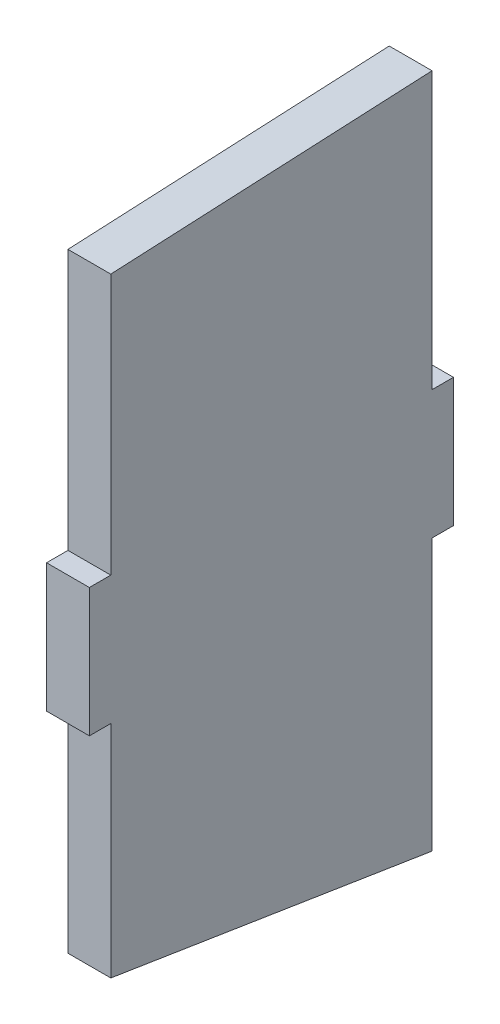
ISO-10303-21;
HEADER;
FILE_DESCRIPTION(('STEP AP214'),'2;1');
FILE_NAME('part.step','',(''),(''),'','','');
FILE_SCHEMA(('AUTOMOTIVE_DESIGN { 1 0 10303 214 1 1 1 1 }'));
ENDSEC;
DATA;
#1=APPLICATION_CONTEXT('core data for automotive mechanical design processes');
#2=APPLICATION_PROTOCOL_DEFINITION('international standard','automotive_design',2000,#1);
#3=PRODUCT_CONTEXT('',#1,'mechanical');
#4=PRODUCT('Part','Part','',(#3));
#5=PRODUCT_RELATED_PRODUCT_CATEGORY('part','',(#4));
#6=PRODUCT_DEFINITION_FORMATION('','',#4);
#7=PRODUCT_DEFINITION_CONTEXT('part definition',#1,'design');
#8=PRODUCT_DEFINITION('design','',#6,#7);
#9=PRODUCT_DEFINITION_SHAPE('','',#8);
#10=(LENGTH_UNIT() NAMED_UNIT(*) SI_UNIT(.MILLI.,.METRE.));
#11=(NAMED_UNIT(*) PLANE_ANGLE_UNIT() SI_UNIT($,.RADIAN.));
#12=(NAMED_UNIT(*) SI_UNIT($,.STERADIAN.) SOLID_ANGLE_UNIT());
#13=UNCERTAINTY_MEASURE_WITH_UNIT(LENGTH_MEASURE(1.E-05),#10,'distance_accuracy_value','');
#14=(GEOMETRIC_REPRESENTATION_CONTEXT(3) GLOBAL_UNCERTAINTY_ASSIGNED_CONTEXT((#13)) GLOBAL_UNIT_ASSIGNED_CONTEXT((#10,
#11,#12)) REPRESENTATION_CONTEXT('',''));
#15=CARTESIAN_POINT('',(0.,0.,0.));
#16=DIRECTION('',(0.,0.,1.));
#17=DIRECTION('',(1.,0.,0.));
#18=AXIS2_PLACEMENT_3D('',#15,#16,#17);
#19=CARTESIAN_POINT('',(25.4,0.,95.25));
#20=DIRECTION('',(0.,0.,1.));
#21=DIRECTION('',(1.,0.,0.));
#22=AXIS2_PLACEMENT_3D('',#19,#20,#21);
#23=PLANE('',#22);
#24=DIRECTION('',(0.,1.,0.));
#25=VECTOR('',#24,1.);
#26=CARTESIAN_POINT('',(0.,0.,95.25));
#27=LINE('',#26,#25);
#28=CARTESIAN_POINT('',(0.,38.1,95.25));
#29=VERTEX_POINT('',#28);
#30=CARTESIAN_POINT('',(0.,192.69579571,95.25));
#31=VERTEX_POINT('',#30);
#32=EDGE_CURVE('E159',#29,#31,#27,.T.);
#33=ORIENTED_EDGE('',*,*,#32,.F.);
#34=DIRECTION('',(-1.,0.,0.));
#35=VECTOR('',#34,1.);
#36=CARTESIAN_POINT('',(25.4,38.1,95.25));
#37=LINE('',#36,#35);
#38=CARTESIAN_POINT('',(25.4,38.1,95.25));
#39=VERTEX_POINT('',#38);
#40=EDGE_CURVE('E11',#39,#29,#37,.T.);
#41=ORIENTED_EDGE('',*,*,#40,.F.);
#42=DIRECTION('',(0.,1.,0.));
#43=VECTOR('',#42,1.);
#44=CARTESIAN_POINT('',(25.4,0.,95.25));
#45=LINE('',#44,#43);
#46=CARTESIAN_POINT('',(25.4,192.69579571,95.25));
#47=VERTEX_POINT('',#46);
#48=EDGE_CURVE('E188',#39,#47,#45,.T.);
#49=ORIENTED_EDGE('',*,*,#48,.T.);
#50=DIRECTION('',(-1.,0.,0.));
#51=VECTOR('',#50,1.);
#52=CARTESIAN_POINT('',(25.4,192.69579571,95.25));
#53=LINE('',#52,#51);
#54=EDGE_CURVE('E57',#47,#31,#53,.T.);
#55=ORIENTED_EDGE('',*,*,#54,.T.);
#56=EDGE_LOOP('',(#33,#41,#49,#55));
#57=FACE_BOUND('',#56,.T.);
#58=ADVANCED_FACE('F41',(#57),#23,.T.);
#59=CARTESIAN_POINT('',(25.4,38.1,0.));
#60=DIRECTION('',(0.,1.,0.));
#61=DIRECTION('',(0.,0.,1.));
#62=AXIS2_PLACEMENT_3D('',#59,#60,#61);
#63=PLANE('',#62);
#64=DIRECTION('',(0.,0.,-1.));
#65=VECTOR('',#64,1.);
#66=CARTESIAN_POINT('',(0.,38.1,0.));
#67=LINE('',#66,#65);
#68=CARTESIAN_POINT('',(0.,38.1,107.95));
#69=VERTEX_POINT('',#68);
#70=EDGE_CURVE('E161',#69,#29,#67,.T.);
#71=ORIENTED_EDGE('',*,*,#70,.F.);
#72=DIRECTION('',(-1.,0.,0.));
#73=VECTOR('',#72,1.);
#74=CARTESIAN_POINT('',(25.4,38.1,107.95));
#75=LINE('',#74,#73);
#76=CARTESIAN_POINT('',(25.4,38.1,107.95));
#77=VERTEX_POINT('',#76);
#78=EDGE_CURVE('E49',#77,#69,#75,.T.);
#79=ORIENTED_EDGE('',*,*,#78,.F.);
#80=DIRECTION('',(0.,0.,-1.));
#81=VECTOR('',#80,1.);
#82=CARTESIAN_POINT('',(25.4,38.1,0.));
#83=LINE('',#82,#81);
#84=EDGE_CURVE('E231',#77,#39,#83,.T.);
#85=ORIENTED_EDGE('',*,*,#84,.T.);
#86=ORIENTED_EDGE('',*,*,#40,.T.);
#87=EDGE_LOOP('',(#71,#79,#85,#86));
#88=FACE_BOUND('',#87,.T.);
#89=ADVANCED_FACE('F216',(#88),#63,.T.);
#90=CARTESIAN_POINT('',(25.4,0.,107.95));
#91=DIRECTION('',(0.,0.,1.));
#92=DIRECTION('',(1.,0.,0.));
#93=AXIS2_PLACEMENT_3D('',#90,#91,#92);
#94=PLANE('',#93);
#95=DIRECTION('',(0.,1.,0.));
#96=VECTOR('',#95,1.);
#97=CARTESIAN_POINT('',(0.,0.,107.95));
#98=LINE('',#97,#96);
#99=CARTESIAN_POINT('',(0.,-38.1,107.95));
#100=VERTEX_POINT('',#99);
#101=EDGE_CURVE('E164',#100,#69,#98,.T.);
#102=ORIENTED_EDGE('',*,*,#101,.F.);
#103=DIRECTION('',(-1.,0.,0.));
#104=VECTOR('',#103,1.);
#105=CARTESIAN_POINT('',(25.4,-38.1,107.95));
#106=LINE('',#105,#104);
#107=CARTESIAN_POINT('',(25.4,-38.1,107.95));
#108=VERTEX_POINT('',#107);
#109=EDGE_CURVE('E205',#108,#100,#106,.T.);
#110=ORIENTED_EDGE('',*,*,#109,.F.);
#111=DIRECTION('',(0.,1.,0.));
#112=VECTOR('',#111,1.);
#113=CARTESIAN_POINT('',(25.4,0.,107.95));
#114=LINE('',#113,#112);
#115=EDGE_CURVE('E212',#108,#77,#114,.T.);
#116=ORIENTED_EDGE('',*,*,#115,.T.);
#117=ORIENTED_EDGE('',*,*,#78,.T.);
#118=EDGE_LOOP('',(#102,#110,#116,#117));
#119=FACE_BOUND('',#118,.T.);
#120=ADVANCED_FACE('F210',(#119),#94,.T.);
#121=CARTESIAN_POINT('',(25.4,-38.1,0.));
#122=DIRECTION('',(0.,1.,0.));
#123=DIRECTION('',(0.,0.,1.));
#124=AXIS2_PLACEMENT_3D('',#121,#122,#123);
#125=PLANE('',#124);
#126=DIRECTION('',(0.,0.,-1.));
#127=VECTOR('',#126,1.);
#128=CARTESIAN_POINT('',(0.,-38.1,0.));
#129=LINE('',#128,#127);
#130=CARTESIAN_POINT('',(0.,-38.1,95.25));
#131=VERTEX_POINT('',#130);
#132=EDGE_CURVE('E167',#100,#131,#129,.T.);
#133=ORIENTED_EDGE('',*,*,#132,.T.);
#134=DIRECTION('',(-1.,0.,0.));
#135=VECTOR('',#134,1.);
#136=CARTESIAN_POINT('',(25.4,-38.1,95.25));
#137=LINE('',#136,#135);
#138=CARTESIAN_POINT('',(25.4,-38.1,95.25));
#139=VERTEX_POINT('',#138);
#140=EDGE_CURVE('E203',#139,#131,#137,.T.);
#141=ORIENTED_EDGE('',*,*,#140,.F.);
#142=DIRECTION('',(0.,0.,-1.));
#143=VECTOR('',#142,1.);
#144=CARTESIAN_POINT('',(25.4,-38.1,0.));
#145=LINE('',#144,#143);
#146=EDGE_CURVE('E227',#108,#139,#145,.T.);
#147=ORIENTED_EDGE('',*,*,#146,.F.);
#148=ORIENTED_EDGE('',*,*,#109,.T.);
#149=EDGE_LOOP('',(#133,#141,#147,#148));
#150=FACE_BOUND('',#149,.T.);
#151=ADVANCED_FACE('F224',(#150),#125,.F.);
#152=CARTESIAN_POINT('',(25.4,0.,95.25));
#153=DIRECTION('',(0.,0.,1.));
#154=DIRECTION('',(1.,0.,0.));
#155=AXIS2_PLACEMENT_3D('',#152,#153,#154);
#156=PLANE('',#155);
#157=DIRECTION('',(0.,1.,0.));
#158=VECTOR('',#157,1.);
#159=CARTESIAN_POINT('',(0.,0.,95.25));
#160=LINE('',#159,#158);
#161=CARTESIAN_POINT('',(0.,-168.80022374,95.25));
#162=VERTEX_POINT('',#161);
#163=EDGE_CURVE('E170',#162,#131,#160,.T.);
#164=ORIENTED_EDGE('',*,*,#163,.F.);
#165=DIRECTION('',(-1.,0.,0.));
#166=VECTOR('',#165,1.);
#167=CARTESIAN_POINT('',(25.4,-168.80022374,95.25));
#168=LINE('',#167,#166);
#169=CARTESIAN_POINT('',(25.4,-168.80022374,95.25));
#170=VERTEX_POINT('',#169);
#171=EDGE_CURVE('E201',#170,#162,#168,.T.);
#172=ORIENTED_EDGE('',*,*,#171,.F.);
#173=DIRECTION('',(0.,1.,0.));
#174=VECTOR('',#173,1.);
#175=CARTESIAN_POINT('',(25.4,0.,95.25));
#176=LINE('',#175,#174);
#177=EDGE_CURVE('E229',#170,#139,#176,.T.);
#178=ORIENTED_EDGE('',*,*,#177,.T.);
#179=ORIENTED_EDGE('',*,*,#140,.T.);
#180=EDGE_LOOP('',(#164,#172,#178,#179));
#181=FACE_BOUND('',#180,.T.);
#182=ADVANCED_FACE('F271',(#181),#156,.T.);
#183=CARTESIAN_POINT('',(25.4,-179.371106228958,28.3369275421519));
#184=DIRECTION('',(0.,0.987750089381214,-0.156044099303385));
#185=DIRECTION('',(0.,0.156044099303385,0.987750089381214));
#186=AXIS2_PLACEMENT_3D('',#183,#184,#185);
#187=PLANE('',#186);
#188=DIRECTION('',(0.,-0.156044099303385,-0.987750089381214));
#189=VECTOR('',#188,1.);
#190=CARTESIAN_POINT('',(0.,-179.371106228958,28.3369275421519));
#191=LINE('',#190,#189);
#192=CARTESIAN_POINT('',(0.,-198.895286486,-95.25));
#193=VERTEX_POINT('',#192);
#194=EDGE_CURVE('E173',#162,#193,#191,.T.);
#195=ORIENTED_EDGE('',*,*,#194,.T.);
#196=DIRECTION('',(-1.,0.,0.));
#197=VECTOR('',#196,1.);
#198=CARTESIAN_POINT('',(25.4,-198.895286486,-95.25));
#199=LINE('',#198,#197);
#200=CARTESIAN_POINT('',(25.4,-198.895286486,-95.25));
#201=VERTEX_POINT('',#200);
#202=EDGE_CURVE('E198',#201,#193,#199,.T.);
#203=ORIENTED_EDGE('',*,*,#202,.F.);
#204=DIRECTION('',(0.,-0.156044099303385,-0.987750089381214));
#205=VECTOR('',#204,1.);
#206=CARTESIAN_POINT('',(25.4,-179.371106228958,28.3369275421519));
#207=LINE('',#206,#205);
#208=EDGE_CURVE('E237',#170,#201,#207,.T.);
#209=ORIENTED_EDGE('',*,*,#208,.F.);
#210=ORIENTED_EDGE('',*,*,#171,.T.);
#211=EDGE_LOOP('',(#195,#203,#209,#210));
#212=FACE_BOUND('',#211,.T.);
#213=ADVANCED_FACE('F274',(#212),#187,.F.);
#214=CARTESIAN_POINT('',(25.4,0.,-95.25));
#215=DIRECTION('',(0.,0.,1.));
#216=DIRECTION('',(1.,0.,0.));
#217=AXIS2_PLACEMENT_3D('',#214,#215,#216);
#218=PLANE('',#217);
#219=DIRECTION('',(0.,1.,0.));
#220=VECTOR('',#219,1.);
#221=CARTESIAN_POINT('',(0.,0.,-95.25));
#222=LINE('',#221,#220);
#223=CARTESIAN_POINT('',(0.,-38.1,-95.25));
#224=VERTEX_POINT('',#223);
#225=EDGE_CURVE('E175',#193,#224,#222,.T.);
#226=ORIENTED_EDGE('',*,*,#225,.T.);
#227=DIRECTION('',(-1.,0.,0.));
#228=VECTOR('',#227,1.);
#229=CARTESIAN_POINT('',(25.4,-38.1,-95.25));
#230=LINE('',#229,#228);
#231=CARTESIAN_POINT('',(25.4,-38.1,-95.25));
#232=VERTEX_POINT('',#231);
#233=EDGE_CURVE('E195',#232,#224,#230,.T.);
#234=ORIENTED_EDGE('',*,*,#233,.F.);
#235=DIRECTION('',(0.,1.,0.));
#236=VECTOR('',#235,1.);
#237=CARTESIAN_POINT('',(25.4,0.,-95.25));
#238=LINE('',#237,#236);
#239=EDGE_CURVE('E239',#201,#232,#238,.T.);
#240=ORIENTED_EDGE('',*,*,#239,.F.);
#241=ORIENTED_EDGE('',*,*,#202,.T.);
#242=EDGE_LOOP('',(#226,#234,#240,#241));
#243=FACE_BOUND('',#242,.T.);
#244=ADVANCED_FACE('F278',(#243),#218,.F.);
#245=CARTESIAN_POINT('',(25.4,-38.1,0.));
#246=DIRECTION('',(0.,1.,0.));
#247=DIRECTION('',(0.,0.,1.));
#248=AXIS2_PLACEMENT_3D('',#245,#246,#247);
#249=PLANE('',#248);
#250=DIRECTION('',(0.,0.,-1.));
#251=VECTOR('',#250,1.);
#252=CARTESIAN_POINT('',(0.,-38.1,0.));
#253=LINE('',#252,#251);
#254=CARTESIAN_POINT('',(0.,-38.1,-107.95));
#255=VERTEX_POINT('',#254);
#256=EDGE_CURVE('E177',#224,#255,#253,.T.);
#257=ORIENTED_EDGE('',*,*,#256,.T.);
#258=DIRECTION('',(-1.,0.,0.));
#259=VECTOR('',#258,1.);
#260=CARTESIAN_POINT('',(25.4,-38.1,-107.95));
#261=LINE('',#260,#259);
#262=CARTESIAN_POINT('',(25.4,-38.1,-107.95));
#263=VERTEX_POINT('',#262);
#264=EDGE_CURVE('E192',#263,#255,#261,.T.);
#265=ORIENTED_EDGE('',*,*,#264,.F.);
#266=DIRECTION('',(0.,0.,-1.));
#267=VECTOR('',#266,1.);
#268=CARTESIAN_POINT('',(25.4,-38.1,0.));
#269=LINE('',#268,#267);
#270=EDGE_CURVE('E154',#232,#263,#269,.T.);
#271=ORIENTED_EDGE('',*,*,#270,.F.);
#272=ORIENTED_EDGE('',*,*,#233,.T.);
#273=EDGE_LOOP('',(#257,#265,#271,#272));
#274=FACE_BOUND('',#273,.T.);
#275=ADVANCED_FACE('F245',(#274),#249,.F.);
#276=CARTESIAN_POINT('',(25.4,0.,-107.95));
#277=DIRECTION('',(0.,0.,1.));
#278=DIRECTION('',(1.,0.,0.));
#279=AXIS2_PLACEMENT_3D('',#276,#277,#278);
#280=PLANE('',#279);
#281=DIRECTION('',(0.,1.,0.));
#282=VECTOR('',#281,1.);
#283=CARTESIAN_POINT('',(0.,0.,-107.95));
#284=LINE('',#283,#282);
#285=CARTESIAN_POINT('',(0.,38.1,-107.95));
#286=VERTEX_POINT('',#285);
#287=EDGE_CURVE('E179',#255,#286,#284,.T.);
#288=ORIENTED_EDGE('',*,*,#287,.T.);
#289=DIRECTION('',(-1.,0.,0.));
#290=VECTOR('',#289,1.);
#291=CARTESIAN_POINT('',(25.4,38.1,-107.95));
#292=LINE('',#291,#290);
#293=CARTESIAN_POINT('',(25.4,38.1,-107.95));
#294=VERTEX_POINT('',#293);
#295=EDGE_CURVE('E141',#294,#286,#292,.T.);
#296=ORIENTED_EDGE('',*,*,#295,.F.);
#297=DIRECTION('',(0.,1.,0.));
#298=VECTOR('',#297,1.);
#299=CARTESIAN_POINT('',(25.4,0.,-107.95));
#300=LINE('',#299,#298);
#301=EDGE_CURVE('E151',#263,#294,#300,.T.);
#302=ORIENTED_EDGE('',*,*,#301,.F.);
#303=ORIENTED_EDGE('',*,*,#264,.T.);
#304=EDGE_LOOP('',(#288,#296,#302,#303));
#305=FACE_BOUND('',#304,.T.);
#306=ADVANCED_FACE('F249',(#305),#280,.F.);
#307=CARTESIAN_POINT('',(25.4,38.1,0.));
#308=DIRECTION('',(0.,1.,0.));
#309=DIRECTION('',(0.,0.,1.));
#310=AXIS2_PLACEMENT_3D('',#307,#308,#309);
#311=PLANE('',#310);
#312=DIRECTION('',(0.,0.,-1.));
#313=VECTOR('',#312,1.);
#314=CARTESIAN_POINT('',(0.,38.1,0.));
#315=LINE('',#314,#313);
#316=CARTESIAN_POINT('',(0.,38.1,-95.25));
#317=VERTEX_POINT('',#316);
#318=EDGE_CURVE('E138',#317,#286,#315,.T.);
#319=ORIENTED_EDGE('',*,*,#318,.F.);
#320=DIRECTION('',(-1.,0.,0.));
#321=VECTOR('',#320,1.);
#322=CARTESIAN_POINT('',(25.4,38.1,-95.25));
#323=LINE('',#322,#321);
#324=CARTESIAN_POINT('',(25.4,38.1,-95.25));
#325=VERTEX_POINT('',#324);
#326=EDGE_CURVE('E132',#325,#317,#323,.T.);
#327=ORIENTED_EDGE('',*,*,#326,.F.);
#328=DIRECTION('',(0.,0.,-1.));
#329=VECTOR('',#328,1.);
#330=CARTESIAN_POINT('',(25.4,38.1,0.));
#331=LINE('',#330,#329);
#332=EDGE_CURVE('E136',#325,#294,#331,.T.);
#333=ORIENTED_EDGE('',*,*,#332,.T.);
#334=ORIENTED_EDGE('',*,*,#295,.T.);
#335=EDGE_LOOP('',(#319,#327,#333,#334));
#336=FACE_BOUND('',#335,.T.);
#337=ADVANCED_FACE('F134',(#336),#311,.T.);
#338=CARTESIAN_POINT('',(25.4,0.,-95.25));
#339=DIRECTION('',(0.,0.,1.));
#340=DIRECTION('',(1.,0.,0.));
#341=AXIS2_PLACEMENT_3D('',#338,#339,#340);
#342=PLANE('',#341);
#343=DIRECTION('',(0.,1.,0.));
#344=VECTOR('',#343,1.);
#345=CARTESIAN_POINT('',(0.,0.,-95.25));
#346=LINE('',#345,#344);
#347=CARTESIAN_POINT('',(0.,201.879837032,-95.25));
#348=VERTEX_POINT('',#347);
#349=EDGE_CURVE('E183',#317,#348,#346,.T.);
#350=ORIENTED_EDGE('',*,*,#349,.T.);
#351=DIRECTION('',(-1.,0.,0.));
#352=VECTOR('',#351,1.);
#353=CARTESIAN_POINT('',(25.4,201.879837032,-95.25));
#354=LINE('',#353,#352);
#355=CARTESIAN_POINT('',(25.4,201.879837032,-95.25));
#356=VERTEX_POINT('',#355);
#357=EDGE_CURVE('E95',#356,#348,#354,.T.);
#358=ORIENTED_EDGE('',*,*,#357,.F.);
#359=DIRECTION('',(0.,1.,0.));
#360=VECTOR('',#359,1.);
#361=CARTESIAN_POINT('',(25.4,0.,-95.25));
#362=LINE('',#361,#360);
#363=EDGE_CURVE('E143',#325,#356,#362,.T.);
#364=ORIENTED_EDGE('',*,*,#363,.F.);
#365=ORIENTED_EDGE('',*,*,#326,.T.);
#366=EDGE_LOOP('',(#350,#358,#364,#365));
#367=FACE_BOUND('',#366,.T.);
#368=ADVANCED_FACE('F144',(#367),#342,.F.);
#369=CARTESIAN_POINT('',(25.4,196.830338871838,9.4892281659959));
#370=DIRECTION('',(0.,0.998839910596127,0.0481542625353155));
#371=DIRECTION('',(0.,-0.0481542625353155,0.998839910596128));
#372=AXIS2_PLACEMENT_3D('',#369,#370,#371);
#373=PLANE('',#372);
#374=DIRECTION('',(0.,0.0481542625353155,-0.998839910596128));
#375=VECTOR('',#374,1.);
#376=CARTESIAN_POINT('',(0.,196.830338871838,9.4892281659959));
#377=LINE('',#376,#375);
#378=EDGE_CURVE('E185',#31,#348,#377,.T.);
#379=ORIENTED_EDGE('',*,*,#378,.F.);
#380=ORIENTED_EDGE('',*,*,#54,.F.);
#381=DIRECTION('',(0.,0.0481542625353155,-0.998839910596128));
#382=VECTOR('',#381,1.);
#383=CARTESIAN_POINT('',(25.4,196.830338871838,9.4892281659959));
#384=LINE('',#383,#382);
#385=EDGE_CURVE('E147',#47,#356,#384,.T.);
#386=ORIENTED_EDGE('',*,*,#385,.T.);
#387=ORIENTED_EDGE('',*,*,#357,.T.);
#388=EDGE_LOOP('',(#379,#380,#386,#387));
#389=FACE_BOUND('',#388,.T.);
#390=ADVANCED_FACE('F250',(#389),#373,.T.);
#391=CARTESIAN_POINT('',(25.4,0.,0.));
#392=DIRECTION('',(1.,0.,0.));
#393=DIRECTION('',(0.,0.,-1.));
#394=AXIS2_PLACEMENT_3D('',#391,#392,#393);
#395=PLANE('',#394);
#396=ORIENTED_EDGE('',*,*,#48,.F.);
#397=ORIENTED_EDGE('',*,*,#84,.F.);
#398=ORIENTED_EDGE('',*,*,#115,.F.);
#399=ORIENTED_EDGE('',*,*,#146,.T.);
#400=ORIENTED_EDGE('',*,*,#177,.F.);
#401=ORIENTED_EDGE('',*,*,#208,.T.);
#402=ORIENTED_EDGE('',*,*,#239,.T.);
#403=ORIENTED_EDGE('',*,*,#270,.T.);
#404=ORIENTED_EDGE('',*,*,#301,.T.);
#405=ORIENTED_EDGE('',*,*,#332,.F.);
#406=ORIENTED_EDGE('',*,*,#363,.T.);
#407=ORIENTED_EDGE('',*,*,#385,.F.);
#408=EDGE_LOOP('',(#396,#397,#398,#399,#400,#401,#402,#403,#404,#405,#406,#407));
#409=FACE_BOUND('',#408,.T.);
#410=ADVANCED_FACE('F149',(#409),#395,.T.);
#411=CARTESIAN_POINT('',(0.,0.,0.));
#412=DIRECTION('',(1.,0.,0.));
#413=DIRECTION('',(0.,0.,-1.));
#414=AXIS2_PLACEMENT_3D('',#411,#412,#413);
#415=PLANE('',#414);
#416=ORIENTED_EDGE('',*,*,#32,.T.);
#417=ORIENTED_EDGE('',*,*,#378,.T.);
#418=ORIENTED_EDGE('',*,*,#349,.F.);
#419=ORIENTED_EDGE('',*,*,#318,.T.);
#420=ORIENTED_EDGE('',*,*,#287,.F.);
#421=ORIENTED_EDGE('',*,*,#256,.F.);
#422=ORIENTED_EDGE('',*,*,#225,.F.);
#423=ORIENTED_EDGE('',*,*,#194,.F.);
#424=ORIENTED_EDGE('',*,*,#163,.T.);
#425=ORIENTED_EDGE('',*,*,#132,.F.);
#426=ORIENTED_EDGE('',*,*,#101,.T.);
#427=ORIENTED_EDGE('',*,*,#70,.T.);
#428=EDGE_LOOP('',(#416,#417,#418,#419,#420,#421,#422,#423,#424,#425,#426,#427));
#429=FACE_BOUND('',#428,.T.);
#430=ADVANCED_FACE('F219',(#429),#415,.F.);
#431=CLOSED_SHELL('',(#58,#89,#120,#151,#182,#213,#244,#275,#306,#337,#368,#390,#410,#430));
#432=MANIFOLD_SOLID_BREP('B2',#431);
#433=ADVANCED_BREP_SHAPE_REPRESENTATION('',(#18,#432),#14);
#434=SHAPE_DEFINITION_REPRESENTATION(#9,#433);
ENDSEC;
END-ISO-10303-21;
